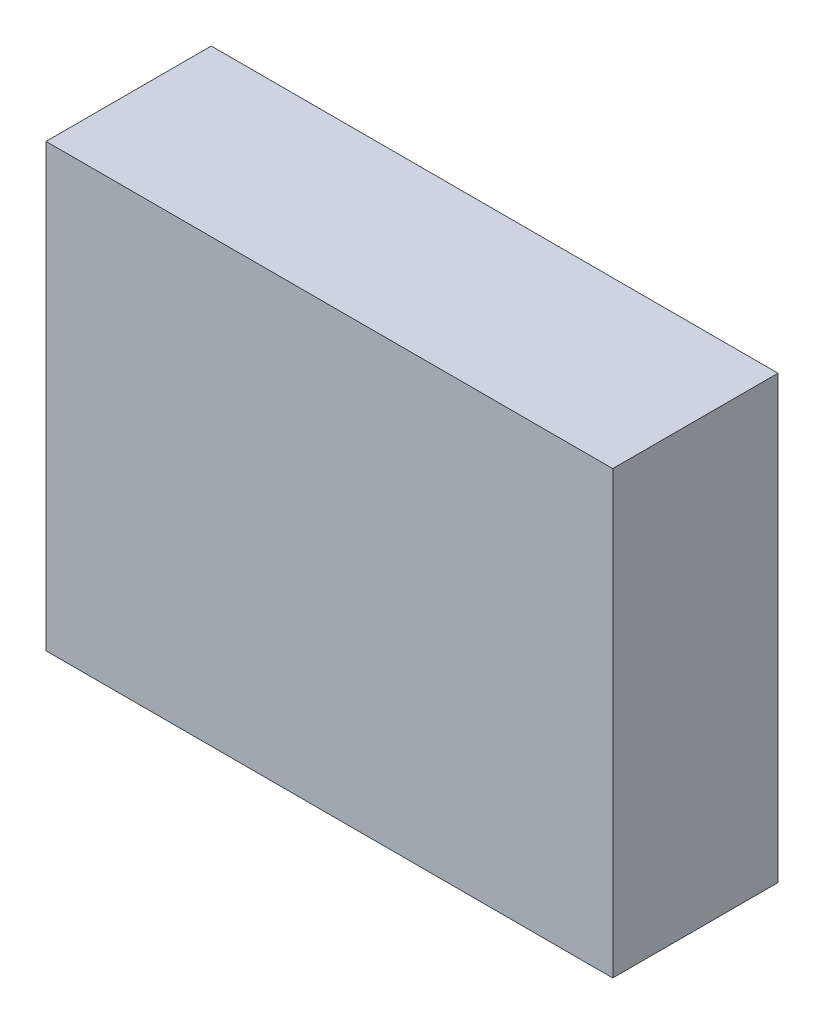
ISO-10303-21;
HEADER;
FILE_DESCRIPTION(('STEP AP214'),'2;1');
FILE_NAME('part.step','',(''),(''),'','','');
FILE_SCHEMA(('AUTOMOTIVE_DESIGN { 1 0 10303 214 1 1 1 1 }'));
ENDSEC;
DATA;
#1=APPLICATION_CONTEXT('core data for automotive mechanical design processes');
#2=APPLICATION_PROTOCOL_DEFINITION('international standard','automotive_design',2000,#1);
#3=PRODUCT_CONTEXT('',#1,'mechanical');
#4=PRODUCT('Part','Part','',(#3));
#5=PRODUCT_RELATED_PRODUCT_CATEGORY('part','',(#4));
#6=PRODUCT_DEFINITION_FORMATION('','',#4);
#7=PRODUCT_DEFINITION_CONTEXT('part definition',#1,'design');
#8=PRODUCT_DEFINITION('design','',#6,#7);
#9=PRODUCT_DEFINITION_SHAPE('','',#8);
#10=(LENGTH_UNIT() NAMED_UNIT(*) SI_UNIT(.MILLI.,.METRE.));
#11=(NAMED_UNIT(*) PLANE_ANGLE_UNIT() SI_UNIT($,.RADIAN.));
#12=(NAMED_UNIT(*) SI_UNIT($,.STERADIAN.) SOLID_ANGLE_UNIT());
#13=UNCERTAINTY_MEASURE_WITH_UNIT(LENGTH_MEASURE(1.E-05),#10,'distance_accuracy_value','');
#14=(GEOMETRIC_REPRESENTATION_CONTEXT(3) GLOBAL_UNCERTAINTY_ASSIGNED_CONTEXT((#13)) GLOBAL_UNIT_ASSIGNED_CONTEXT((#10,
#11,#12)) REPRESENTATION_CONTEXT('',''));
#15=CARTESIAN_POINT('',(0.,0.,0.));
#16=DIRECTION('',(0.,0.,1.));
#17=DIRECTION('',(1.,0.,0.));
#18=AXIS2_PLACEMENT_3D('',#15,#16,#17);
#19=CARTESIAN_POINT('',(34.3,26.7,20.));
#20=DIRECTION('',(-1.,0.,0.));
#21=DIRECTION('',(0.,0.,1.));
#22=AXIS2_PLACEMENT_3D('',#19,#20,#21);
#23=PLANE('',#22);
#24=DIRECTION('',(0.,1.,0.));
#25=VECTOR('',#24,1.);
#26=CARTESIAN_POINT('',(34.3,26.7,0.));
#27=LINE('',#26,#25);
#28=CARTESIAN_POINT('',(34.3,-26.7,0.));
#29=VERTEX_POINT('',#28);
#30=CARTESIAN_POINT('',(34.3,26.7,0.));
#31=VERTEX_POINT('',#30);
#32=EDGE_CURVE('E107',#29,#31,#27,.T.);
#33=ORIENTED_EDGE('',*,*,#32,.T.);
#34=DIRECTION('',(0.,0.,-1.));
#35=VECTOR('',#34,1.);
#36=CARTESIAN_POINT('',(34.3,26.7,20.));
#37=LINE('',#36,#35);
#38=CARTESIAN_POINT('',(34.3,26.7,20.));
#39=VERTEX_POINT('',#38);
#40=EDGE_CURVE('E11',#39,#31,#37,.T.);
#41=ORIENTED_EDGE('',*,*,#40,.F.);
#42=DIRECTION('',(0.,1.,0.));
#43=VECTOR('',#42,1.);
#44=CARTESIAN_POINT('',(34.3,26.7,20.));
#45=LINE('',#44,#43);
#46=CARTESIAN_POINT('',(34.3,-26.7,20.));
#47=VERTEX_POINT('',#46);
#48=EDGE_CURVE('E91',#47,#39,#45,.T.);
#49=ORIENTED_EDGE('',*,*,#48,.F.);
#50=DIRECTION('',(0.,0.,-1.));
#51=VECTOR('',#50,1.);
#52=CARTESIAN_POINT('',(34.3,-26.7,20.));
#53=LINE('',#52,#51);
#54=EDGE_CURVE('E103',#47,#29,#53,.T.);
#55=ORIENTED_EDGE('',*,*,#54,.T.);
#56=EDGE_LOOP('',(#33,#41,#49,#55));
#57=FACE_BOUND('',#56,.T.);
#58=ADVANCED_FACE('F39',(#57),#23,.F.);
#59=CARTESIAN_POINT('',(-34.3,26.7,20.));
#60=DIRECTION('',(0.,-1.,0.));
#61=DIRECTION('',(0.,0.,-1.));
#62=AXIS2_PLACEMENT_3D('',#59,#60,#61);
#63=PLANE('',#62);
#64=DIRECTION('',(-1.,0.,0.));
#65=VECTOR('',#64,1.);
#66=CARTESIAN_POINT('',(-34.3,26.7,0.));
#67=LINE('',#66,#65);
#68=CARTESIAN_POINT('',(-34.3,26.7,0.));
#69=VERTEX_POINT('',#68);
#70=EDGE_CURVE('E96',#31,#69,#67,.T.);
#71=ORIENTED_EDGE('',*,*,#70,.T.);
#72=DIRECTION('',(0.,0.,-1.));
#73=VECTOR('',#72,1.);
#74=CARTESIAN_POINT('',(-34.3,26.7,20.));
#75=LINE('',#74,#73);
#76=CARTESIAN_POINT('',(-34.3,26.7,20.));
#77=VERTEX_POINT('',#76);
#78=EDGE_CURVE('E48',#77,#69,#75,.T.);
#79=ORIENTED_EDGE('',*,*,#78,.F.);
#80=DIRECTION('',(-1.,0.,0.));
#81=VECTOR('',#80,1.);
#82=CARTESIAN_POINT('',(-34.3,26.7,20.));
#83=LINE('',#82,#81);
#84=EDGE_CURVE('E86',#39,#77,#83,.T.);
#85=ORIENTED_EDGE('',*,*,#84,.F.);
#86=ORIENTED_EDGE('',*,*,#40,.T.);
#87=EDGE_LOOP('',(#71,#79,#85,#86));
#88=FACE_BOUND('',#87,.T.);
#89=ADVANCED_FACE('F95',(#88),#63,.F.);
#90=CARTESIAN_POINT('',(-34.3,26.7,20.));
#91=DIRECTION('',(1.,0.,0.));
#92=DIRECTION('',(0.,0.,-1.));
#93=AXIS2_PLACEMENT_3D('',#90,#91,#92);
#94=PLANE('',#93);
#95=DIRECTION('',(0.,-1.,0.));
#96=VECTOR('',#95,1.);
#97=CARTESIAN_POINT('',(-34.3,26.7,0.));
#98=LINE('',#97,#96);
#99=CARTESIAN_POINT('',(-34.3,-26.7,0.));
#100=VERTEX_POINT('',#99);
#101=EDGE_CURVE('E73',#69,#100,#98,.T.);
#102=ORIENTED_EDGE('',*,*,#101,.T.);
#103=DIRECTION('',(0.,0.,-1.));
#104=VECTOR('',#103,1.);
#105=CARTESIAN_POINT('',(-34.3,-26.7,20.));
#106=LINE('',#105,#104);
#107=CARTESIAN_POINT('',(-34.3,-26.7,20.));
#108=VERTEX_POINT('',#107);
#109=EDGE_CURVE('E98',#108,#100,#106,.T.);
#110=ORIENTED_EDGE('',*,*,#109,.F.);
#111=DIRECTION('',(0.,-1.,0.));
#112=VECTOR('',#111,1.);
#113=CARTESIAN_POINT('',(-34.3,26.7,20.));
#114=LINE('',#113,#112);
#115=EDGE_CURVE('E89',#77,#108,#114,.T.);
#116=ORIENTED_EDGE('',*,*,#115,.F.);
#117=ORIENTED_EDGE('',*,*,#78,.T.);
#118=EDGE_LOOP('',(#102,#110,#116,#117));
#119=FACE_BOUND('',#118,.T.);
#120=ADVANCED_FACE('F99',(#119),#94,.F.);
#121=CARTESIAN_POINT('',(-34.3,-26.7,20.));
#122=DIRECTION('',(0.,1.,0.));
#123=DIRECTION('',(0.,0.,1.));
#124=AXIS2_PLACEMENT_3D('',#121,#122,#123);
#125=PLANE('',#124);
#126=DIRECTION('',(1.,0.,0.));
#127=VECTOR('',#126,1.);
#128=CARTESIAN_POINT('',(-34.3,-26.7,0.));
#129=LINE('',#128,#127);
#130=EDGE_CURVE('E79',#100,#29,#129,.T.);
#131=ORIENTED_EDGE('',*,*,#130,.T.);
#132=ORIENTED_EDGE('',*,*,#54,.F.);
#133=DIRECTION('',(1.,0.,0.));
#134=VECTOR('',#133,1.);
#135=CARTESIAN_POINT('',(-34.3,-26.7,20.));
#136=LINE('',#135,#134);
#137=EDGE_CURVE('E56',#108,#47,#136,.T.);
#138=ORIENTED_EDGE('',*,*,#137,.F.);
#139=ORIENTED_EDGE('',*,*,#109,.T.);
#140=EDGE_LOOP('',(#131,#132,#138,#139));
#141=FACE_BOUND('',#140,.T.);
#142=ADVANCED_FACE('F120',(#141),#125,.F.);
#143=CARTESIAN_POINT('',(0.,0.,20.));
#144=DIRECTION('',(0.,0.,1.));
#145=DIRECTION('',(1.,0.,0.));
#146=AXIS2_PLACEMENT_3D('',#143,#144,#145);
#147=PLANE('',#146);
#148=ORIENTED_EDGE('',*,*,#48,.T.);
#149=ORIENTED_EDGE('',*,*,#84,.T.);
#150=ORIENTED_EDGE('',*,*,#115,.T.);
#151=ORIENTED_EDGE('',*,*,#137,.T.);
#152=EDGE_LOOP('',(#148,#149,#150,#151));
#153=FACE_BOUND('',#152,.T.);
#154=ADVANCED_FACE('F87',(#153),#147,.T.);
#155=CARTESIAN_POINT('',(0.,0.,0.));
#156=DIRECTION('',(0.,0.,1.));
#157=DIRECTION('',(1.,0.,0.));
#158=AXIS2_PLACEMENT_3D('',#155,#156,#157);
#159=PLANE('',#158);
#160=ORIENTED_EDGE('',*,*,#32,.F.);
#161=ORIENTED_EDGE('',*,*,#130,.F.);
#162=ORIENTED_EDGE('',*,*,#101,.F.);
#163=ORIENTED_EDGE('',*,*,#70,.F.);
#164=EDGE_LOOP('',(#160,#161,#162,#163));
#165=FACE_BOUND('',#164,.T.);
#166=ADVANCED_FACE('F123',(#165),#159,.F.);
#167=CLOSED_SHELL('',(#58,#89,#120,#142,#154,#166));
#168=MANIFOLD_SOLID_BREP('B2',#167);
#169=ADVANCED_BREP_SHAPE_REPRESENTATION('',(#18,#168),#14);
#170=SHAPE_DEFINITION_REPRESENTATION(#9,#169);
ENDSEC;
END-ISO-10303-21;
